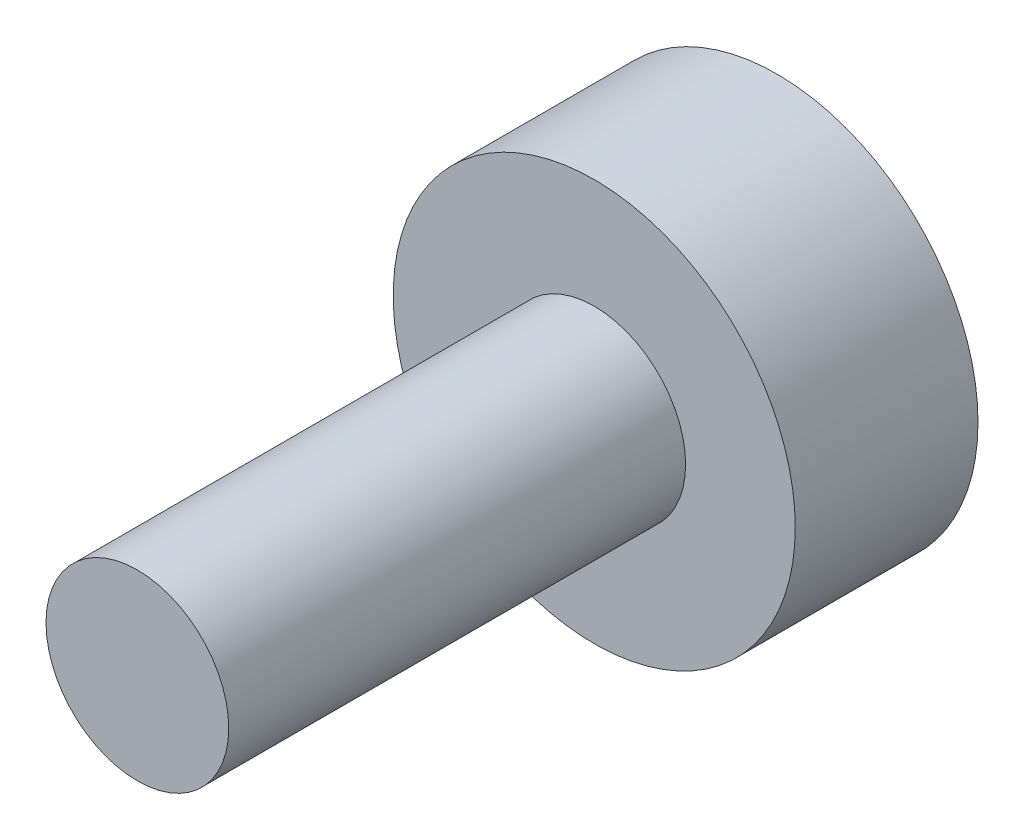
ISO-10303-21;
HEADER;
FILE_DESCRIPTION(('STEP AP214'),'2;1');
FILE_NAME('part.step','',(''),(''),'','','');
FILE_SCHEMA(('AUTOMOTIVE_DESIGN { 1 0 10303 214 1 1 1 1 }'));
ENDSEC;
DATA;
#1=APPLICATION_CONTEXT('core data for automotive mechanical design processes');
#2=APPLICATION_PROTOCOL_DEFINITION('international standard','automotive_design',2000,#1);
#3=PRODUCT_CONTEXT('',#1,'mechanical');
#4=PRODUCT('Part','Part','',(#3));
#5=PRODUCT_RELATED_PRODUCT_CATEGORY('part','',(#4));
#6=PRODUCT_DEFINITION_FORMATION('','',#4);
#7=PRODUCT_DEFINITION_CONTEXT('part definition',#1,'design');
#8=PRODUCT_DEFINITION('design','',#6,#7);
#9=PRODUCT_DEFINITION_SHAPE('','',#8);
#10=(LENGTH_UNIT() NAMED_UNIT(*) SI_UNIT(.MILLI.,.METRE.));
#11=(NAMED_UNIT(*) PLANE_ANGLE_UNIT() SI_UNIT($,.RADIAN.));
#12=(NAMED_UNIT(*) SI_UNIT($,.STERADIAN.) SOLID_ANGLE_UNIT());
#13=UNCERTAINTY_MEASURE_WITH_UNIT(LENGTH_MEASURE(1.E-05),#10,'distance_accuracy_value','');
#14=(GEOMETRIC_REPRESENTATION_CONTEXT(3) GLOBAL_UNCERTAINTY_ASSIGNED_CONTEXT((#13)) GLOBAL_UNIT_ASSIGNED_CONTEXT((#10,
#11,#12)) REPRESENTATION_CONTEXT('',''));
#15=CARTESIAN_POINT('',(0.,0.,0.));
#16=DIRECTION('',(0.,0.,1.));
#17=DIRECTION('',(1.,0.,0.));
#18=AXIS2_PLACEMENT_3D('',#15,#16,#17);
#19=CARTESIAN_POINT('',(0.,0.,10.));
#20=DIRECTION('',(0.,0.,-1.));
#21=DIRECTION('',(-1.,0.,0.));
#22=AXIS2_PLACEMENT_3D('',#19,#20,#21);
#23=CYLINDRICAL_SURFACE('',#22,11.);
#24=CARTESIAN_POINT('',(0.,0.,10.));
#25=DIRECTION('',(0.,0.,1.));
#26=DIRECTION('',(1.,0.,0.));
#27=AXIS2_PLACEMENT_3D('',#24,#25,#26);
#28=CIRCLE('',#27,11.);
#29=CARTESIAN_POINT('',(11.,0.,10.));
#30=VERTEX_POINT('',#29);
#31=EDGE_CURVE('E39',#30,#30,#28,.T.);
#32=ORIENTED_EDGE('',*,*,#31,.F.);
#33=EDGE_LOOP('',(#32));
#34=FACE_BOUND('',#33,.T.);
#35=CARTESIAN_POINT('',(0.,0.,0.));
#36=DIRECTION('',(0.,0.,1.));
#37=DIRECTION('',(1.,0.,0.));
#38=AXIS2_PLACEMENT_3D('',#35,#36,#37);
#39=CIRCLE('',#38,11.);
#40=CARTESIAN_POINT('',(11.,0.,0.));
#41=VERTEX_POINT('',#40);
#42=EDGE_CURVE('E35',#41,#41,#39,.T.);
#43=ORIENTED_EDGE('',*,*,#42,.T.);
#44=EDGE_LOOP('',(#43));
#45=FACE_BOUND('',#44,.T.);
#46=ADVANCED_FACE('F32',(#34,#45),#23,.T.);
#47=CARTESIAN_POINT('',(0.,0.,10.));
#48=DIRECTION('',(0.,0.,1.));
#49=DIRECTION('',(1.,0.,0.));
#50=AXIS2_PLACEMENT_3D('',#47,#48,#49);
#51=PLANE('',#50);
#52=CARTESIAN_POINT('',(0.,0.,10.));
#53=DIRECTION('',(0.,0.,1.));
#54=DIRECTION('',(1.,0.,0.));
#55=AXIS2_PLACEMENT_3D('',#52,#53,#54);
#56=CIRCLE('',#55,5.);
#57=CARTESIAN_POINT('',(5.,0.,10.));
#58=VERTEX_POINT('',#57);
#59=EDGE_CURVE('E10',#58,#58,#56,.T.);
#60=ORIENTED_EDGE('',*,*,#59,.F.);
#61=EDGE_LOOP('',(#60));
#62=FACE_BOUND('',#61,.T.);
#63=ORIENTED_EDGE('',*,*,#31,.T.);
#64=EDGE_LOOP('',(#63));
#65=FACE_BOUND('',#64,.T.);
#66=ADVANCED_FACE('F56',(#62,#65),#51,.T.);
#67=CARTESIAN_POINT('',(0.,0.,0.));
#68=DIRECTION('',(0.,0.,1.));
#69=DIRECTION('',(1.,0.,0.));
#70=AXIS2_PLACEMENT_3D('',#67,#68,#69);
#71=PLANE('',#70);
#72=ORIENTED_EDGE('',*,*,#42,.F.);
#73=EDGE_LOOP('',(#72));
#74=FACE_BOUND('',#73,.T.);
#75=ADVANCED_FACE('F53',(#74),#71,.F.);
#76=CARTESIAN_POINT('',(0.,0.,35.));
#77=DIRECTION('',(0.,0.,-1.));
#78=DIRECTION('',(-1.,0.,0.));
#79=AXIS2_PLACEMENT_3D('',#76,#77,#78);
#80=CYLINDRICAL_SURFACE('',#79,5.);
#81=CARTESIAN_POINT('',(0.,0.,35.));
#82=DIRECTION('',(0.,0.,1.));
#83=DIRECTION('',(1.,0.,0.));
#84=AXIS2_PLACEMENT_3D('',#81,#82,#83);
#85=CIRCLE('',#84,5.);
#86=CARTESIAN_POINT('',(5.,0.,35.));
#87=VERTEX_POINT('',#86);
#88=EDGE_CURVE('E45',#87,#87,#85,.T.);
#89=ORIENTED_EDGE('',*,*,#88,.F.);
#90=EDGE_LOOP('',(#89));
#91=FACE_BOUND('',#90,.T.);
#92=ORIENTED_EDGE('',*,*,#59,.T.);
#93=EDGE_LOOP('',(#92));
#94=FACE_BOUND('',#93,.T.);
#95=ADVANCED_FACE('F55',(#91,#94),#80,.T.);
#96=CARTESIAN_POINT('',(0.,0.,35.));
#97=DIRECTION('',(0.,0.,1.));
#98=DIRECTION('',(1.,0.,0.));
#99=AXIS2_PLACEMENT_3D('',#96,#97,#98);
#100=PLANE('',#99);
#101=ORIENTED_EDGE('',*,*,#88,.T.);
#102=EDGE_LOOP('',(#101));
#103=FACE_BOUND('',#102,.T.);
#104=ADVANCED_FACE('F61',(#103),#100,.T.);
#105=CLOSED_SHELL('',(#46,#66,#75,#95,#104));
#106=MANIFOLD_SOLID_BREP('B2',#105);
#107=ADVANCED_BREP_SHAPE_REPRESENTATION('',(#18,#106),#14);
#108=SHAPE_DEFINITION_REPRESENTATION(#9,#107);
ENDSEC;
END-ISO-10303-21;
